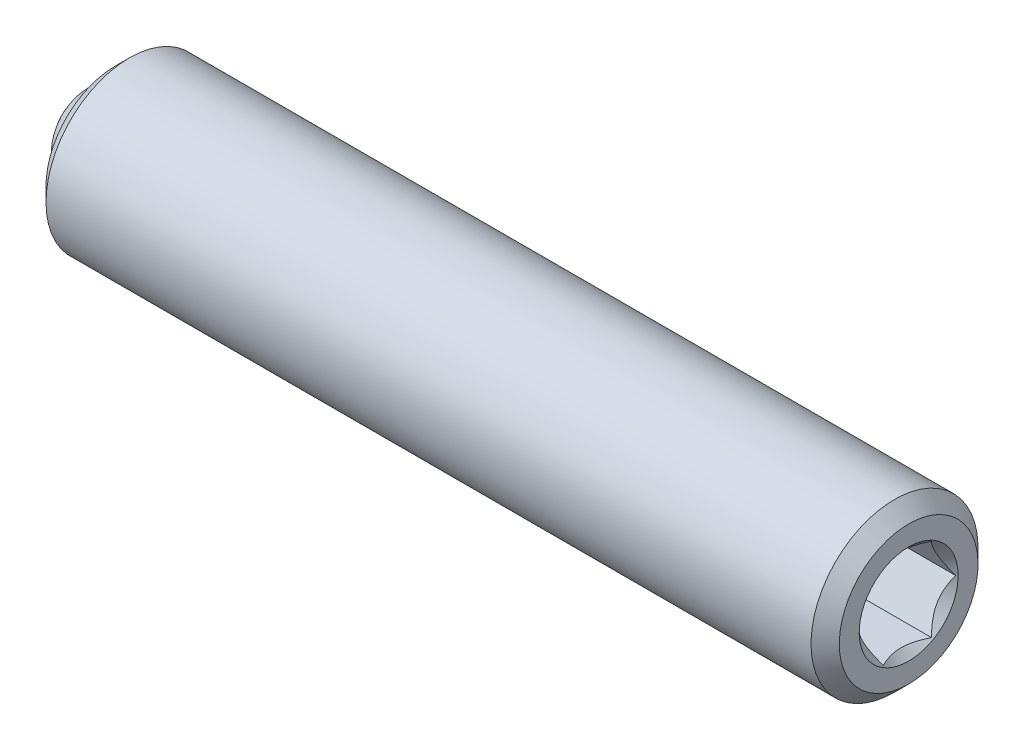
ISO-10303-21;
HEADER;
FILE_DESCRIPTION(('STEP AP214'),'2;1');
FILE_NAME('part.step','',(''),(''),'','','');
FILE_SCHEMA(('AUTOMOTIVE_DESIGN { 1 0 10303 214 1 1 1 1 }'));
ENDSEC;
DATA;
#1=APPLICATION_CONTEXT('core data for automotive mechanical design processes');
#2=APPLICATION_PROTOCOL_DEFINITION('international standard','automotive_design',2000,#1);
#3=PRODUCT_CONTEXT('',#1,'mechanical');
#4=PRODUCT('Part','Part','',(#3));
#5=PRODUCT_RELATED_PRODUCT_CATEGORY('part','',(#4));
#6=PRODUCT_DEFINITION_FORMATION('','',#4);
#7=PRODUCT_DEFINITION_CONTEXT('part definition',#1,'design');
#8=PRODUCT_DEFINITION('design','',#6,#7);
#9=PRODUCT_DEFINITION_SHAPE('','',#8);
#10=(LENGTH_UNIT() NAMED_UNIT(*) SI_UNIT(.MILLI.,.METRE.));
#11=(NAMED_UNIT(*) PLANE_ANGLE_UNIT() SI_UNIT($,.RADIAN.));
#12=(NAMED_UNIT(*) SI_UNIT($,.STERADIAN.) SOLID_ANGLE_UNIT());
#13=UNCERTAINTY_MEASURE_WITH_UNIT(LENGTH_MEASURE(1.E-05),#10,'distance_accuracy_value','');
#14=(GEOMETRIC_REPRESENTATION_CONTEXT(3) GLOBAL_UNCERTAINTY_ASSIGNED_CONTEXT((#13)) GLOBAL_UNIT_ASSIGNED_CONTEXT((#10,
#11,#12)) REPRESENTATION_CONTEXT('',''));
#15=CARTESIAN_POINT('',(0.,0.,0.));
#16=DIRECTION('',(0.,0.,1.));
#17=DIRECTION('',(1.,0.,0.));
#18=AXIS2_PLACEMENT_3D('',#15,#16,#17);
#19=CARTESIAN_POINT('',(-7.08387664832727,0.140112200938348,-0.203857779682182));
#20=DIRECTION('',(-1.,0.,0.));
#21=DIRECTION('',(0.,-1.,0.));
#22=AXIS2_PLACEMENT_3D('',#19,#20,#21);
#23=CONICAL_SURFACE('',#22,1.0033,0.78539816339745);
#24=CARTESIAN_POINT('',(-6.08057664832728,0.140112200938348,-0.203857779682182));
#25=VERTEX_POINT('',#24);
#26=VERTEX_LOOP('',#25);
#27=FACE_BOUND('',#26,.T.);
#28=CARTESIAN_POINT('',(-7.08387664832727,0.140112200938348,-0.203857779682182));
#29=DIRECTION('',(-1.,0.,0.));
#30=DIRECTION('',(0.,-1.,0.));
#31=AXIS2_PLACEMENT_3D('',#28,#29,#30);
#32=CIRCLE('',#31,1.0033);
#33=CARTESIAN_POINT('',(-7.08387664832727,-0.863187799061651,-0.203857779682182));
#34=VERTEX_POINT('',#33);
#35=EDGE_CURVE('P0_E102',#34,#34,#32,.T.);
#36=ORIENTED_EDGE('',*,*,#35,.T.);
#37=EDGE_LOOP('',(#36));
#38=FACE_BOUND('',#37,.T.);
#39=ADVANCED_FACE('P0_F17',(#27,#38),#23,.F.);
#40=CARTESIAN_POINT('',(6.49244103821644,0.140112200938348,-0.203857779682182));
#41=DIRECTION('',(-1.,0.,0.));
#42=DIRECTION('',(0.,-1.,0.));
#43=AXIS2_PLACEMENT_3D('',#40,#41,#42);
#44=PLANE('',#43);
#45=CARTESIAN_POINT('',(6.49244103821644,0.140112200938348,-0.203857779682182));
#46=DIRECTION('',(1.,0.,0.));
#47=DIRECTION('',(0.,1.,0.));
#48=AXIS2_PLACEMENT_3D('',#45,#46,#47);
#49=CIRCLE('',#48,0.889);
#50=CARTESIAN_POINT('',(6.49244103821644,1.02911220093835,-0.203857779682182));
#51=VERTEX_POINT('',#50);
#52=EDGE_CURVE('P0_E233',#51,#51,#49,.T.);
#53=ORIENTED_EDGE('',*,*,#52,.F.);
#54=EDGE_LOOP('',(#53));
#55=FACE_BOUND('',#54,.T.);
#56=CARTESIAN_POINT('',(6.49244103821644,0.140112200938348,-0.203857779682182));
#57=DIRECTION('',(-1.,0.,0.));
#58=DIRECTION('',(0.,-1.,0.));
#59=AXIS2_PLACEMENT_3D('',#56,#57,#58);
#60=CIRCLE('',#59,1.24600000000003);
#61=CARTESIAN_POINT('',(6.49244103821644,-1.10588779906168,-0.203857779682182));
#62=VERTEX_POINT('',#61);
#63=EDGE_CURVE('P0_E114',#62,#62,#60,.F.);
#64=ORIENTED_EDGE('',*,*,#63,.T.);
#65=EDGE_LOOP('',(#64));
#66=FACE_BOUND('',#65,.T.);
#67=ADVANCED_FACE('P0_F136',(#55,#66),#44,.F.);
#68=CARTESIAN_POINT('',(-6.08057664832728,0.140112200938348,-0.203857779682182));
#69=DIRECTION('',(-1.,0.,0.));
#70=DIRECTION('',(0.,-1.,0.));
#71=AXIS2_PLACEMENT_3D('',#68,#69,#70);
#72=CYLINDRICAL_SURFACE('',#71,1.50000000000001);
#73=CARTESIAN_POINT('',(6.23844103821645,0.140112200938348,-0.203857779682182));
#74=DIRECTION('',(-1.,0.,0.));
#75=DIRECTION('',(0.,-1.,0.));
#76=AXIS2_PLACEMENT_3D('',#73,#74,#75);
#77=CIRCLE('',#76,1.50000000000001);
#78=CARTESIAN_POINT('',(6.23844103821645,-1.35988779906166,-0.203857779682182));
#79=VERTEX_POINT('',#78);
#80=EDGE_CURVE('P0_E111',#79,#79,#77,.T.);
#81=ORIENTED_EDGE('',*,*,#80,.T.);
#82=EDGE_LOOP('',(#81));
#83=FACE_BOUND('',#82,.T.);
#84=CARTESIAN_POINT('',(-7.50295896178355,0.140112200938348,-0.203857779682182));
#85=DIRECTION('',(1.,0.,0.));
#86=DIRECTION('',(0.,1.,0.));
#87=AXIS2_PLACEMENT_3D('',#84,#85,#86);
#88=CIRCLE('',#87,1.50000000000001);
#89=CARTESIAN_POINT('',(-7.50295896178355,1.64011220093836,-0.203857779682182));
#90=VERTEX_POINT('',#89);
#91=EDGE_CURVE('P0_E108',#90,#90,#88,.T.);
#92=ORIENTED_EDGE('',*,*,#91,.T.);
#93=EDGE_LOOP('',(#92));
#94=FACE_BOUND('',#93,.T.);
#95=ADVANCED_FACE('P0_F141',(#83,#94),#72,.T.);
#96=CARTESIAN_POINT('',(-7.75695896178356,1.64011220093835,-0.203857779682182));
#97=DIRECTION('',(1.,0.,0.));
#98=DIRECTION('',(0.,1.,0.));
#99=AXIS2_PLACEMENT_3D('',#96,#97,#98);
#100=PLANE('',#99);
#101=CARTESIAN_POINT('',(-7.75695896178356,0.140112200938348,-0.203857779682182));
#102=DIRECTION('',(1.,0.,0.));
#103=DIRECTION('',(0.,1.,0.));
#104=AXIS2_PLACEMENT_3D('',#101,#102,#103);
#105=CIRCLE('',#104,1.246);
#106=CARTESIAN_POINT('',(-7.75695896178356,1.38611220093834,-0.203857779682182));
#107=VERTEX_POINT('',#106);
#108=EDGE_CURVE('P0_E30',#107,#107,#105,.F.);
#109=ORIENTED_EDGE('',*,*,#108,.T.);
#110=EDGE_LOOP('',(#109));
#111=FACE_BOUND('',#110,.T.);
#112=CARTESIAN_POINT('',(-7.75695896178356,0.140112200938348,-0.203857779682182));
#113=DIRECTION('',(-1.,0.,0.));
#114=DIRECTION('',(0.,-1.,0.));
#115=AXIS2_PLACEMENT_3D('',#112,#113,#114);
#116=CIRCLE('',#115,1.0033);
#117=CARTESIAN_POINT('',(-7.75695896178356,-0.863187799061651,-0.203857779682182));
#118=VERTEX_POINT('',#117);
#119=EDGE_CURVE('P0_E105',#118,#118,#116,.T.);
#120=ORIENTED_EDGE('',*,*,#119,.F.);
#121=EDGE_LOOP('',(#120));
#122=FACE_BOUND('',#121,.T.);
#123=ADVANCED_FACE('P0_F119',(#111,#122),#100,.F.);
#124=CARTESIAN_POINT('',(-6.08057664832728,0.140112200938348,-0.203857779682182));
#125=DIRECTION('',(-1.,0.,0.));
#126=DIRECTION('',(0.,-1.,0.));
#127=AXIS2_PLACEMENT_3D('',#124,#125,#126);
#128=CYLINDRICAL_SURFACE('',#127,1.0033);
#129=ORIENTED_EDGE('',*,*,#35,.F.);
#130=EDGE_LOOP('',(#129));
#131=FACE_BOUND('',#130,.T.);
#132=ORIENTED_EDGE('',*,*,#119,.T.);
#133=EDGE_LOOP('',(#132));
#134=FACE_BOUND('',#133,.T.);
#135=ADVANCED_FACE('P0_F132',(#131,#134),#128,.F.);
#136=CARTESIAN_POINT('',(6.23844103821645,0.140112200938348,-0.203857779682182));
#137=DIRECTION('',(-1.,0.,0.));
#138=DIRECTION('',(0.,-1.,0.));
#139=AXIS2_PLACEMENT_3D('',#136,#137,#138);
#140=CONICAL_SURFACE('',#139,1.50000000000001,0.785398163397447);
#141=ORIENTED_EDGE('',*,*,#63,.F.);
#142=EDGE_LOOP('',(#141));
#143=FACE_BOUND('',#142,.T.);
#144=ORIENTED_EDGE('',*,*,#80,.F.);
#145=EDGE_LOOP('',(#144));
#146=FACE_BOUND('',#145,.T.);
#147=ADVANCED_FACE('P0_F123',(#143,#146),#140,.T.);
#148=CARTESIAN_POINT('',(-7.75695896178356,0.140112200938348,-0.203857779682182));
#149=DIRECTION('',(1.,0.,0.));
#150=DIRECTION('',(0.,1.,0.));
#151=AXIS2_PLACEMENT_3D('',#148,#149,#150);
#152=CONICAL_SURFACE('',#151,1.246,0.785398163397447);
#153=ORIENTED_EDGE('',*,*,#91,.F.);
#154=EDGE_LOOP('',(#153));
#155=FACE_BOUND('',#154,.T.);
#156=ORIENTED_EDGE('',*,*,#108,.F.);
#157=EDGE_LOOP('',(#156));
#158=FACE_BOUND('',#157,.T.);
#159=ADVANCED_FACE('P0_F19',(#155,#158),#152,.T.);
#160=CARTESIAN_POINT('',(6.49244103821644,0.140112200938348,-0.203857779682182));
#161=DIRECTION('',(1.,0.,0.));
#162=DIRECTION('',(0.,1.,0.));
#163=AXIS2_PLACEMENT_3D('',#160,#161,#162);
#164=CONICAL_SURFACE('',#163,0.889,0.78539816339745);
#165=ORIENTED_EDGE('',*,*,#52,.T.);
#166=EDGE_LOOP('',(#165));
#167=FACE_BOUND('',#166,.T.);
#168=CARTESIAN_POINT('',(6.75931407340163,0.890112200938347,-1.08337041374052));
#169=CARTESIAN_POINT('',(6.74307468321521,0.890112200938347,-1.06202509157628));
#170=CARTESIAN_POINT('',(6.72698979157522,0.890112200938347,-1.04056255208413));
#171=CARTESIAN_POINT('',(6.69519327113775,0.890112200938347,-0.997354976569362));
#172=CARTESIAN_POINT('',(6.67948173410769,0.890112200938347,-0.975609873085506));
#173=CARTESIAN_POINT('',(6.6327791702077,0.890112200938347,-0.909560196027857));
#174=CARTESIAN_POINT('',(6.60247002806284,0.890112200938347,-0.864765498836228));
#175=CARTESIAN_POINT('',(6.54282204548442,0.890112200938347,-0.770727906260527));
#176=CARTESIAN_POINT('',(6.51364847758762,0.890112200938347,-0.721378973428742));
#177=CARTESIAN_POINT('',(6.46018003069421,0.890112200938347,-0.620199376924882));
#178=CARTESIAN_POINT('',(6.43586868692797,0.890112200938347,-0.568377850854046));
#179=CARTESIAN_POINT('',(6.40612427189313,0.890112200938347,-0.490735867713309));
#180=CARTESIAN_POINT('',(6.39761515008199,0.890112200938347,-0.466103184642786));
#181=CARTESIAN_POINT('',(6.38256731195443,0.890112200938347,-0.416242867264109));
#182=CARTESIAN_POINT('',(6.37602872705705,0.890112200938347,-0.391015193395759));
#183=CARTESIAN_POINT('',(6.36014826365661,0.890112200938347,-0.315512298621015));
#184=CARTESIAN_POINT('',(6.35414656519245,0.890112200938347,-0.264454169848514));
#185=CARTESIAN_POINT('',(6.35288028255774,0.890112200938347,-0.164196712133303));
#186=CARTESIAN_POINT('',(6.35720545625288,0.890112200938347,-0.115002678500581));
#187=CARTESIAN_POINT('',(6.37030376344025,0.890112200938347,-0.0420620616330128));
#188=CARTESIAN_POINT('',(6.37585433171372,0.890112200938347,-0.0176697553897667));
#189=CARTESIAN_POINT('',(6.38889014752514,0.890112200938347,0.0305909359954264));
#190=CARTESIAN_POINT('',(6.39637525349171,0.890112200938347,0.0544593593370273));
#191=CARTESIAN_POINT('',(6.42255528323793,0.890112200938347,0.128893354159198));
#192=CARTESIAN_POINT('',(6.44420389672139,0.890112200938347,0.178414114462773));
#193=CARTESIAN_POINT('',(6.49235487646798,0.890112200938347,0.275137718993898));
#194=CARTESIAN_POINT('',(6.51887453883852,0.890112200938347,0.3223315181746));
#195=CARTESIAN_POINT('',(6.57360802883982,0.890112200938347,0.412534674067127));
#196=CARTESIAN_POINT('',(6.60167299614644,0.890112200938347,0.455635521889964));
#197=CARTESIAN_POINT('',(6.64506742055101,0.890112200938347,0.519135833531514));
#198=CARTESIAN_POINT('',(6.6596869668323,0.890112200938347,0.540028947080531));
#199=CARTESIAN_POINT('',(6.68931508568023,0.890112200938347,0.58152917501731));
#200=CARTESIAN_POINT('',(6.70432355062861,0.890112200938347,0.602136366150134));
#201=CARTESIAN_POINT('',(6.7194933572417,0.890112200938347,0.622624391209399));
#202=B_SPLINE_CURVE_WITH_KNOTS('',3,(#168,#169,#170,#171,#172,#173,#174,#175,#176,#177,#178,
#179,#180,#181,#182,#183,#184,#185,#186,#187,#188,#189,#190,#191,#192,#193,#194,#195,#196,#197,
#198,#199,#200,#201),.UNSPECIFIED.,.F.,.F.,(4,2,2,2,2,2,2,2,2,2,2,2,2,2,2,2,4),(0.,
0.0804596117681744,0.160938799452028,0.323124453194973,0.494968571191812,0.666220542229087,
0.744331171665942,0.822447009304214,0.975597152051799,1.12276514368749,1.1977430644728,
1.27271549985279,1.4343836465341,1.59663734906444,1.75085876684992,1.82735598888854,
1.90383226465774),.UNSPECIFIED.);
#203=CARTESIAN_POINT('',(6.46946644200088,0.890112200938347,-0.636870481574401));
#204=VERTEX_POINT('',#203);
#205=CARTESIAN_POINT('',(6.46946644200088,0.890112200938347,0.229154922210038));
#206=VERTEX_POINT('',#205);
#207=EDGE_CURVE('P0_E86',#204,#206,#202,.T.);
#208=ORIENTED_EDGE('',*,*,#207,.F.);
#209=CARTESIAN_POINT('',(6.46958193514565,0.139912200938347,-1.06999865352046));
#210=CARTESIAN_POINT('',(6.4547005524648,0.165702163496029,-1.05510881169539));
#211=CARTESIAN_POINT('',(6.44069270760783,0.191923403067007,-1.0399699719706));
#212=CARTESIAN_POINT('',(6.41504396668314,0.245391909174054,-1.00909991557653));
#213=CARTESIAN_POINT('',(6.40341735370654,0.27264426839892,-0.993365758642001));
#214=CARTESIAN_POINT('',(6.38350048777312,0.327597551319701,-0.961638465954834));
#215=CARTESIAN_POINT('',(6.37516013608225,0.355284457633857,-0.945653423141328));
#216=CARTESIAN_POINT('',(6.3623091839623,0.411267796069201,-0.913331427625549));
#217=CARTESIAN_POINT('',(6.35778898258971,0.439562515781993,-0.896995463582723));
#218=CARTESIAN_POINT('',(6.35371227509831,0.488322490207191,-0.868843879222656));
#219=CARTESIAN_POINT('',(6.35310923861496,0.508724266593921,-0.857064908133831));
#220=CARTESIAN_POINT('',(6.3541209480164,0.549488335634708,-0.833529761899868));
#221=CARTESIAN_POINT('',(6.35573618299091,0.569850618589803,-0.821773592354429));
#222=CARTESIAN_POINT('',(6.36380258897392,0.630646744025172,-0.786672932968632));
#223=CARTESIAN_POINT('',(6.3734753778286,0.670778055934447,-0.763503109234879));
#224=CARTESIAN_POINT('',(6.39682275997319,0.741222601292374,-0.72283193200954));
#225=CARTESIAN_POINT('',(6.40927500007313,0.771865772947434,-0.705140088605666));
#226=CARTESIAN_POINT('',(6.43732605223174,0.831951546743137,-0.67044955093025));
#227=CARTESIAN_POINT('',(6.45291462790463,0.861397689319938,-0.653448812586938));
#228=CARTESIAN_POINT('',(6.46958193514565,0.890312200938347,-0.636755011520563));
#229=B_SPLINE_CURVE_WITH_KNOTS('',3,(#209,#210,#211,#212,#213,#214,#215,#216,#217,#218,#219,
#220,#221,#222,#223,#224,#225,#226,#227,#228),.UNSPECIFIED.,.F.,.F.,(4,2,2,2,2,2,2,2,2,4),(0.,
0.0999419466095603,0.200466857654447,0.299393763705718,0.398071297300231,0.468665775681749,
0.53927582139884,0.680536257244567,0.792918418368074,0.904939568716032),.UNSPECIFIED.);
#230=CARTESIAN_POINT('',(6.46946644200088,0.140112200938347,-1.06988318346662));
#231=VERTEX_POINT('',#230);
#232=EDGE_CURVE('P0_E188',#231,#204,#229,.T.);
#233=ORIENTED_EDGE('',*,*,#232,.F.);
#234=CARTESIAN_POINT('',(6.46958193514565,-0.610087799061653,-0.636755011520563));
#235=CARTESIAN_POINT('',(6.4547005524648,-0.584297836503971,-0.651644853345631));
#236=CARTESIAN_POINT('',(6.44069270760783,-0.558076596932993,-0.666783693070421));
#237=CARTESIAN_POINT('',(6.41504396668314,-0.504608090825946,-0.697653749464491));
#238=CARTESIAN_POINT('',(6.40341735370655,-0.47735573160108,-0.71338790639902));
#239=CARTESIAN_POINT('',(6.38350048777312,-0.422402448680299,-0.745115199086187));
#240=CARTESIAN_POINT('',(6.37516013608225,-0.394715542366143,-0.761100241899693));
#241=CARTESIAN_POINT('',(6.3623091839623,-0.338732203930799,-0.793422237415473));
#242=CARTESIAN_POINT('',(6.35778898258971,-0.310437484218007,-0.809758201458298));
#243=CARTESIAN_POINT('',(6.35371227509831,-0.261677509792809,-0.837909785818366));
#244=CARTESIAN_POINT('',(6.35310923861496,-0.241275733406079,-0.84968875690719));
#245=CARTESIAN_POINT('',(6.3541209480164,-0.200511664365292,-0.873223903141154));
#246=CARTESIAN_POINT('',(6.35573618299091,-0.180149381410197,-0.884980072686593));
#247=CARTESIAN_POINT('',(6.36380258897392,-0.119353255974828,-0.920080732072389));
#248=CARTESIAN_POINT('',(6.3734753778286,-0.0792219440655525,-0.943250555806142));
#249=CARTESIAN_POINT('',(6.39682275997319,-0.00877739870762611,-0.983921733031482));
#250=CARTESIAN_POINT('',(6.40927500007313,0.0218657729474343,-1.00161357643536));
#251=CARTESIAN_POINT('',(6.43732605223174,0.0819515467431373,-1.03630411411077));
#252=CARTESIAN_POINT('',(6.45291462790463,0.111397689319938,-1.05330485245408));
#253=CARTESIAN_POINT('',(6.46958193514565,0.140312200938347,-1.06999865352046));
#254=B_SPLINE_CURVE_WITH_KNOTS('',3,(#234,#235,#236,#237,#238,#239,#240,#241,#242,#243,#244,
#245,#246,#247,#248,#249,#250,#251,#252,#253),.UNSPECIFIED.,.F.,.F.,(4,2,2,2,2,2,2,2,2,4),(0.,
0.0999419466095599,0.200466857654447,0.299393763705718,0.398071297300232,0.468665775681749,
0.539275821398841,0.680536257244568,0.792918418368075,0.904939568716032),.UNSPECIFIED.);
#255=CARTESIAN_POINT('',(6.46946644200088,-0.609887799061653,-0.636870481574401));
#256=VERTEX_POINT('',#255);
#257=EDGE_CURVE('P0_E183',#256,#231,#254,.T.);
#258=ORIENTED_EDGE('',*,*,#257,.F.);
#259=CARTESIAN_POINT('',(6.75931407342134,-0.609887799061653,-1.08337041376642));
#260=CARTESIAN_POINT('',(6.74307468323415,-0.609887799061653,-1.06202509160144));
#261=CARTESIAN_POINT('',(6.72698979159341,-0.609887799061653,-1.04056255210855));
#262=CARTESIAN_POINT('',(6.69519327115442,-0.609887799061653,-0.997354976592303));
#263=CARTESIAN_POINT('',(6.6794817341236,-0.609887799061653,-0.975609873107702));
#264=CARTESIAN_POINT('',(6.63277917022134,-0.609887799061653,-0.909560196047774));
#265=CARTESIAN_POINT('',(6.60247002807497,-0.609887799061653,-0.864765498854594));
#266=CARTESIAN_POINT('',(6.54282204549342,-0.609887799061653,-0.770727906275514));
#267=CARTESIAN_POINT('',(6.51364847759503,-0.609887799061653,-0.72137897344189));
#268=CARTESIAN_POINT('',(6.46018003069867,-0.609887799061653,-0.620199376934195));
#269=CARTESIAN_POINT('',(6.43586868693107,-0.609887799061653,-0.568377850861364));
#270=CARTESIAN_POINT('',(6.40612427189523,-0.609887799061653,-0.490735867719131));
#271=CARTESIAN_POINT('',(6.39761515008414,-0.609887799061653,-0.466103184649244));
#272=CARTESIAN_POINT('',(6.38256731195656,-0.609887799061653,-0.416242867271859));
#273=CARTESIAN_POINT('',(6.37602872705911,-0.609887799061653,-0.391015193404165));
#274=CARTESIAN_POINT('',(6.36014826365822,-0.609887799061653,-0.315512298631347));
#275=CARTESIAN_POINT('',(6.35414656519346,-0.609887799061653,-0.264454169860129));
#276=CARTESIAN_POINT('',(6.35288028255708,-0.609887799061653,-0.16419671214712));
#277=CARTESIAN_POINT('',(6.35720545625119,-0.609887799061653,-0.115002678515324));
#278=CARTESIAN_POINT('',(6.37030376343688,-0.609887799061653,-0.0420620616490265));
#279=CARTESIAN_POINT('',(6.37585433170976,-0.609887799061653,-0.0176697554062025));
#280=CARTESIAN_POINT('',(6.38889014752,-0.609887799061653,0.0305909359781876));
#281=CARTESIAN_POINT('',(6.39637525348597,-0.609887799061653,0.0544593593194076));
#282=CARTESIAN_POINT('',(6.4225552832294,-0.609887799061653,0.128893354137779));
#283=CARTESIAN_POINT('',(6.44420389671029,-0.609887799061653,0.178414114438127));
#284=CARTESIAN_POINT('',(6.49235487645145,-0.609887799061653,0.275137718963045));
#285=CARTESIAN_POINT('',(6.51887453881914,-0.609887799061653,0.32233151814077));
#286=CARTESIAN_POINT('',(6.57360802881497,-0.609887799061653,0.412534674027946));
#287=CARTESIAN_POINT('',(6.601672996119,-0.609887799061653,0.455635521848392));
#288=CARTESIAN_POINT('',(6.64506742051971,-0.609887799061653,0.519135833486406));
#289=CARTESIAN_POINT('',(6.65968696679972,-0.609887799061653,0.540028947034261));
#290=CARTESIAN_POINT('',(6.6893150856451,-0.609887799061653,0.581529174968724));
#291=CARTESIAN_POINT('',(6.70432355059219,-0.609887799061653,0.602136366100394));
#292=CARTESIAN_POINT('',(6.71949335720401,-0.609887799061653,0.622624391158506));
#293=B_SPLINE_CURVE_WITH_KNOTS('',3,(#259,#260,#261,#262,#263,#264,#265,#266,#267,#268,#269,
#270,#271,#272,#273,#274,#275,#276,#277,#278,#279,#280,#281,#282,#283,#284,#285,#286,#287,#288,
#289,#290,#291,#292),.UNSPECIFIED.,.F.,.F.,(4,2,2,2,2,2,2,2,2,2,2,2,2,2,2,2,4),(0.,
0.0804596117713113,0.160938799458303,0.323124453207641,0.494968571211659,0.666220542256045,
0.744331171691052,0.82244700932748,0.975597152071551,1.12276514370424,1.19774306448793,
1.27271549986629,1.43438364653569,1.59663734905404,1.75085876682928,1.82735598886285,
1.90383226462699),.UNSPECIFIED.);
#294=CARTESIAN_POINT('',(6.46946644200088,-0.609887799061653,0.229154922210038));
#295=VERTEX_POINT('',#294);
#296=EDGE_CURVE('P0_E37',#295,#256,#293,.F.);
#297=ORIENTED_EDGE('',*,*,#296,.F.);
#298=CARTESIAN_POINT('',(6.46958193514565,0.140312200938347,0.662283094156095));
#299=CARTESIAN_POINT('',(6.4547005524648,0.114522238380666,0.647393252331027));
#300=CARTESIAN_POINT('',(6.44069270760783,0.0883009988096879,0.632254412606237));
#301=CARTESIAN_POINT('',(6.41504396668314,0.034832492702641,0.601384356212167));
#302=CARTESIAN_POINT('',(6.40341735370654,0.00758013347777476,0.585650199277638));
#303=CARTESIAN_POINT('',(6.38350048777312,-0.0473731494430053,0.553922906590472));
#304=CARTESIAN_POINT('',(6.37516013608225,-0.0750600557571615,0.537937863776966));
#305=CARTESIAN_POINT('',(6.3623091839623,-0.131043394192505,0.505615868261186));
#306=CARTESIAN_POINT('',(6.35778898258971,-0.159338113905297,0.489279904218361));
#307=CARTESIAN_POINT('',(6.35371227509831,-0.208098088330495,0.461128319858294));
#308=CARTESIAN_POINT('',(6.35310923861496,-0.228499864717224,0.449349348769469));
#309=CARTESIAN_POINT('',(6.3541209480164,-0.269263933758012,0.425814202535506));
#310=CARTESIAN_POINT('',(6.35573618299091,-0.289626216713107,0.414058032990066));
#311=CARTESIAN_POINT('',(6.36380258897392,-0.350422342148476,0.37895737360427));
#312=CARTESIAN_POINT('',(6.3734753778286,-0.390553654057751,0.355787549870517));
#313=CARTESIAN_POINT('',(6.39682275997319,-0.460998199415678,0.315116372645177));
#314=CARTESIAN_POINT('',(6.40927500007313,-0.491641371070739,0.297424529241304));
#315=CARTESIAN_POINT('',(6.43732605223174,-0.551727144866442,0.262733991565887));
#316=CARTESIAN_POINT('',(6.45291462790463,-0.581173287443243,0.245733253222575));
#317=CARTESIAN_POINT('',(6.46958193514565,-0.610087799061653,0.2290394521562));
#318=B_SPLINE_CURVE_WITH_KNOTS('',3,(#298,#299,#300,#301,#302,#303,#304,#305,#306,#307,#308,
#309,#310,#311,#312,#313,#314,#315,#316,#317),.UNSPECIFIED.,.F.,.F.,(4,2,2,2,2,2,2,2,2,4),(0.,
0.0999419466095594,0.200466857654445,0.299393763705716,0.398071297300229,0.468665775681746,
0.539275821398838,0.680536257244565,0.792918418368073,0.904939568716032),.UNSPECIFIED.);
#319=CARTESIAN_POINT('',(6.46946644200088,0.140112200938347,0.662167624102257));
#320=VERTEX_POINT('',#319);
#321=EDGE_CURVE('P0_E11',#320,#295,#318,.T.);
#322=ORIENTED_EDGE('',*,*,#321,.F.);
#323=CARTESIAN_POINT('',(6.46958193514565,0.890312200938347,0.2290394521562));
#324=CARTESIAN_POINT('',(6.4547005524648,0.864522238380666,0.243929293981268));
#325=CARTESIAN_POINT('',(6.44069270760783,0.838300998809688,0.259068133706057));
#326=CARTESIAN_POINT('',(6.41504396668314,0.784832492702641,0.289938190100128));
#327=CARTESIAN_POINT('',(6.40341735370654,0.757580133477775,0.305672347034657));
#328=CARTESIAN_POINT('',(6.38350048777312,0.702626850556994,0.337399639721823));
#329=CARTESIAN_POINT('',(6.37516013608225,0.674939944242838,0.353384682535329));
#330=CARTESIAN_POINT('',(6.3623091839623,0.618956605807494,0.385706678051109));
#331=CARTESIAN_POINT('',(6.35778898258971,0.590661886094703,0.402042642093934));
#332=CARTESIAN_POINT('',(6.35371227509831,0.541901911669504,0.430194226454002));
#333=CARTESIAN_POINT('',(6.35310923861496,0.521500135282775,0.441973197542826));
#334=CARTESIAN_POINT('',(6.3541209480164,0.480736066241988,0.465508343776789));
#335=CARTESIAN_POINT('',(6.35573618299091,0.460373783286893,0.477264513322229));
#336=CARTESIAN_POINT('',(6.36380258897392,0.399577657851524,0.512365172708025));
#337=CARTESIAN_POINT('',(6.3734753778286,0.359446345942249,0.535534996441778));
#338=CARTESIAN_POINT('',(6.39682275997319,0.289001800584322,0.576206173667118));
#339=CARTESIAN_POINT('',(6.40927500007313,0.258358628929261,0.593898017070991));
#340=CARTESIAN_POINT('',(6.43732605223174,0.198272855133557,0.628588554746408));
#341=CARTESIAN_POINT('',(6.45291462790463,0.168826712556756,0.64558929308972));
#342=CARTESIAN_POINT('',(6.46958193514565,0.139912200938347,0.662283094156095));
#343=B_SPLINE_CURVE_WITH_KNOTS('',3,(#323,#324,#325,#326,#327,#328,#329,#330,#331,#332,#333,
#334,#335,#336,#337,#338,#339,#340,#341,#342),.UNSPECIFIED.,.F.,.F.,(4,2,2,2,2,2,2,2,2,4),(0.,
0.0999419466095594,0.200466857654446,0.299393763705717,0.39807129730023,0.468665775681747,
0.539275821398839,0.680536257244566,0.792918418368073,0.904939568716032),.UNSPECIFIED.);
#344=EDGE_CURVE('P0_E73',#206,#320,#343,.T.);
#345=ORIENTED_EDGE('',*,*,#344,.F.);
#346=EDGE_LOOP('',(#208,#233,#258,#297,#322,#345));
#347=FACE_BOUND('',#346,.T.);
#348=ADVANCED_FACE('P0_F72',(#167,#347),#164,.F.);
#349=CARTESIAN_POINT('',(3.44444103821644,0.140112200938347,-0.203857779682182));
#350=DIRECTION('',(1.,0.,0.));
#351=DIRECTION('',(0.,0.,-1.));
#352=AXIS2_PLACEMENT_3D('',#349,#350,#351);
#353=PLANE('',#352);
#354=DIRECTION('',(0.,-0.866025403784439,0.5));
#355=VECTOR('',#354,1.);
#356=CARTESIAN_POINT('',(3.44444103821644,0.890112200938347,0.229154922210038));
#357=LINE('',#356,#355);
#358=CARTESIAN_POINT('',(3.44444103821644,0.890112200938347,0.229154922210038));
#359=VERTEX_POINT('',#358);
#360=CARTESIAN_POINT('',(3.44444103821644,0.140112200938347,0.662167624102257));
#361=VERTEX_POINT('',#360);
#362=EDGE_CURVE('P0_E85',#359,#361,#357,.T.);
#363=ORIENTED_EDGE('',*,*,#362,.T.);
#364=DIRECTION('',(0.,-0.866025403784438,-0.5));
#365=VECTOR('',#364,1.);
#366=CARTESIAN_POINT('',(3.44444103821644,0.140112200938347,0.662167624102257));
#367=LINE('',#366,#365);
#368=CARTESIAN_POINT('',(3.44444103821644,-0.609887799061653,0.229154922210038));
#369=VERTEX_POINT('',#368);
#370=EDGE_CURVE('P0_E90',#361,#369,#367,.T.);
#371=ORIENTED_EDGE('',*,*,#370,.T.);
#372=DIRECTION('',(0.,0.,-1.));
#373=VECTOR('',#372,1.);
#374=CARTESIAN_POINT('',(3.44444103821644,-0.609887799061653,0.229154922210038));
#375=LINE('',#374,#373);
#376=CARTESIAN_POINT('',(3.44444103821644,-0.609887799061653,-0.636870481574401));
#377=VERTEX_POINT('',#376);
#378=EDGE_CURVE('P0_E213',#369,#377,#375,.T.);
#379=ORIENTED_EDGE('',*,*,#378,.T.);
#380=DIRECTION('',(0.,0.866025403784439,-0.5));
#381=VECTOR('',#380,1.);
#382=CARTESIAN_POINT('',(3.44444103821644,-0.609887799061653,-0.636870481574401));
#383=LINE('',#382,#381);
#384=CARTESIAN_POINT('',(3.44444103821644,0.140112200938347,-1.06988318346662));
#385=VERTEX_POINT('',#384);
#386=EDGE_CURVE('P0_E217',#377,#385,#383,.T.);
#387=ORIENTED_EDGE('',*,*,#386,.T.);
#388=DIRECTION('',(0.,0.866025403784439,0.5));
#389=VECTOR('',#388,1.);
#390=CARTESIAN_POINT('',(3.44444103821644,0.140112200938347,-1.06988318346662));
#391=LINE('',#390,#389);
#392=CARTESIAN_POINT('',(3.44444103821644,0.890112200938347,-0.636870481574401));
#393=VERTEX_POINT('',#392);
#394=EDGE_CURVE('P0_E98',#385,#393,#391,.T.);
#395=ORIENTED_EDGE('',*,*,#394,.T.);
#396=DIRECTION('',(0.,0.,1.));
#397=VECTOR('',#396,1.);
#398=CARTESIAN_POINT('',(3.44444103821644,0.890112200938347,-0.636870481574401));
#399=LINE('',#398,#397);
#400=EDGE_CURVE('P0_E93',#393,#359,#399,.T.);
#401=ORIENTED_EDGE('',*,*,#400,.T.);
#402=EDGE_LOOP('',(#363,#371,#379,#387,#395,#401));
#403=FACE_BOUND('',#402,.T.);
#404=ADVANCED_FACE('P0_F130',(#403),#353,.T.);
#405=CARTESIAN_POINT('',(3.44444103821644,0.140112200938347,0.662167624102257));
#406=DIRECTION('',(0.,-0.5,0.866025403784438));
#407=DIRECTION('',(0.,-0.866025403784439,-0.5));
#408=AXIS2_PLACEMENT_3D('',#405,#406,#407);
#409=PLANE('',#408);
#410=DIRECTION('',(1.,0.,0.));
#411=VECTOR('',#410,1.);
#412=CARTESIAN_POINT('',(3.44444103821644,0.140112200938347,0.662167624102257));
#413=LINE('',#412,#411);
#414=EDGE_CURVE('P0_E82',#361,#320,#413,.T.);
#415=ORIENTED_EDGE('',*,*,#414,.T.);
#416=ORIENTED_EDGE('',*,*,#321,.T.);
#417=DIRECTION('',(1.,0.,0.));
#418=VECTOR('',#417,1.);
#419=CARTESIAN_POINT('',(3.44444103821644,-0.609887799061653,0.229154922210038));
#420=LINE('',#419,#418);
#421=EDGE_CURVE('P0_E92',#369,#295,#420,.T.);
#422=ORIENTED_EDGE('',*,*,#421,.F.);
#423=ORIENTED_EDGE('',*,*,#370,.F.);
#424=EDGE_LOOP('',(#415,#416,#422,#423));
#425=FACE_BOUND('',#424,.T.);
#426=ADVANCED_FACE('P0_F88',(#425),#409,.F.);
#427=CARTESIAN_POINT('',(3.44444103821644,-0.609887799061653,0.229154922210038));
#428=DIRECTION('',(0.,-1.,0.));
#429=DIRECTION('',(1.,0.,0.));
#430=AXIS2_PLACEMENT_3D('',#427,#428,#429);
#431=PLANE('',#430);
#432=ORIENTED_EDGE('',*,*,#421,.T.);
#433=ORIENTED_EDGE('',*,*,#296,.T.);
#434=DIRECTION('',(1.,0.,0.));
#435=VECTOR('',#434,1.);
#436=CARTESIAN_POINT('',(3.44444103821644,-0.609887799061653,-0.636870481574401));
#437=LINE('',#436,#435);
#438=EDGE_CURVE('P0_E95',#377,#256,#437,.T.);
#439=ORIENTED_EDGE('',*,*,#438,.F.);
#440=ORIENTED_EDGE('',*,*,#378,.F.);
#441=EDGE_LOOP('',(#432,#433,#439,#440));
#442=FACE_BOUND('',#441,.T.);
#443=ADVANCED_FACE('P0_F202',(#442),#431,.F.);
#444=CARTESIAN_POINT('',(3.44444103821644,-0.609887799061653,-0.636870481574401));
#445=DIRECTION('',(0.,-0.5,-0.866025403784439));
#446=DIRECTION('',(0.,0.866025403784439,-0.5));
#447=AXIS2_PLACEMENT_3D('',#444,#445,#446);
#448=PLANE('',#447);
#449=ORIENTED_EDGE('',*,*,#438,.T.);
#450=ORIENTED_EDGE('',*,*,#257,.T.);
#451=DIRECTION('',(1.,0.,0.));
#452=VECTOR('',#451,1.);
#453=CARTESIAN_POINT('',(3.44444103821644,0.140112200938347,-1.06988318346662));
#454=LINE('',#453,#452);
#455=EDGE_CURVE('P0_E227',#385,#231,#454,.T.);
#456=ORIENTED_EDGE('',*,*,#455,.F.);
#457=ORIENTED_EDGE('',*,*,#386,.F.);
#458=EDGE_LOOP('',(#449,#450,#456,#457));
#459=FACE_BOUND('',#458,.T.);
#460=ADVANCED_FACE('P0_F197',(#459),#448,.F.);
#461=CARTESIAN_POINT('',(3.44444103821644,0.140112200938347,-1.06988318346662));
#462=DIRECTION('',(0.,0.5,-0.866025403784439));
#463=DIRECTION('',(0.,0.866025403784439,0.5));
#464=AXIS2_PLACEMENT_3D('',#461,#462,#463);
#465=PLANE('',#464);
#466=ORIENTED_EDGE('',*,*,#455,.T.);
#467=ORIENTED_EDGE('',*,*,#232,.T.);
#468=DIRECTION('',(1.,0.,0.));
#469=VECTOR('',#468,1.);
#470=CARTESIAN_POINT('',(3.44444103821644,0.890112200938347,-0.636870481574401));
#471=LINE('',#470,#469);
#472=EDGE_CURVE('P0_E224',#393,#204,#471,.T.);
#473=ORIENTED_EDGE('',*,*,#472,.F.);
#474=ORIENTED_EDGE('',*,*,#394,.F.);
#475=EDGE_LOOP('',(#466,#467,#473,#474));
#476=FACE_BOUND('',#475,.T.);
#477=ADVANCED_FACE('P0_F194',(#476),#465,.F.);
#478=CARTESIAN_POINT('',(3.44444103821644,0.890112200938347,-0.636870481574401));
#479=DIRECTION('',(0.,1.,0.));
#480=DIRECTION('',(0.,0.,1.));
#481=AXIS2_PLACEMENT_3D('',#478,#479,#480);
#482=PLANE('',#481);
#483=ORIENTED_EDGE('',*,*,#472,.T.);
#484=ORIENTED_EDGE('',*,*,#207,.T.);
#485=DIRECTION('',(1.,0.,0.));
#486=VECTOR('',#485,1.);
#487=CARTESIAN_POINT('',(3.44444103821644,0.890112200938347,0.229154922210038));
#488=LINE('',#487,#486);
#489=EDGE_CURVE('P0_E84',#359,#206,#488,.T.);
#490=ORIENTED_EDGE('',*,*,#489,.F.);
#491=ORIENTED_EDGE('',*,*,#400,.F.);
#492=EDGE_LOOP('',(#483,#484,#490,#491));
#493=FACE_BOUND('',#492,.T.);
#494=ADVANCED_FACE('P0_F156',(#493),#482,.F.);
#495=CARTESIAN_POINT('',(3.44444103821644,0.890112200938347,0.229154922210038));
#496=DIRECTION('',(0.,0.5,0.866025403784439));
#497=DIRECTION('',(0.,-0.866025403784439,0.5));
#498=AXIS2_PLACEMENT_3D('',#495,#496,#497);
#499=PLANE('',#498);
#500=ORIENTED_EDGE('',*,*,#489,.T.);
#501=ORIENTED_EDGE('',*,*,#344,.T.);
#502=ORIENTED_EDGE('',*,*,#414,.F.);
#503=ORIENTED_EDGE('',*,*,#362,.F.);
#504=EDGE_LOOP('',(#500,#501,#502,#503));
#505=FACE_BOUND('',#504,.T.);
#506=ADVANCED_FACE('P0_F80',(#505),#499,.F.);
#507=CLOSED_SHELL('',(#39,#67,#95,#123,#135,#147,#159,#348,#404,#426,#443,#460,#477,#494,#506));
#508=MANIFOLD_SOLID_BREP('P0_B1',#507);
#509=CARTESIAN_POINT('',(-7.49478738227326,0.140112200938352,-0.203857779682184));
#510=DIRECTION('',(1.,0.,0.));
#511=DIRECTION('',(0.,0.998020621808946,-0.0628875062638402));
#512=AXIS2_PLACEMENT_3D('',#509,#510,#511);
#513=SPHERICAL_SURFACE('',#512,0.999998);
#514=CARTESIAN_POINT('',(-7.49478738227326,0.140112200938352,-0.203857779682184));
#515=DIRECTION('',(0.,-0.0628875062638402,-0.998020621808946));
#516=DIRECTION('',(0.,0.998020621808946,-0.0628875062638402));
#517=AXIS2_PLACEMENT_3D('',#514,#515,#516);
#518=CIRCLE('',#517,0.999998);
#519=CARTESIAN_POINT('',(-7.49478738227326,1.13813082670605,-0.266745160171012));
#520=VERTEX_POINT('',#519);
#521=CARTESIAN_POINT('',(-7.49478738227326,-0.857906424829351,-0.140970399193356));
#522=VERTEX_POINT('',#521);
#523=EDGE_CURVE('P1_E33',#520,#522,#518,.T.);
#524=ORIENTED_EDGE('',*,*,#523,.T.);
#525=CARTESIAN_POINT('',(-7.49478738227326,0.140112200938352,-0.203857779682184));
#526=DIRECTION('',(1.,0.,0.));
#527=DIRECTION('',(0.,-0.0628875062638402,-0.998020621808946));
#528=AXIS2_PLACEMENT_3D('',#525,#526,#527);
#529=CIRCLE('',#528,0.999998);
#530=EDGE_CURVE('P1_E10',#522,#520,#529,.T.);
#531=ORIENTED_EDGE('',*,*,#530,.T.);
#532=EDGE_LOOP('',(#524,#531));
#533=FACE_BOUND('',#532,.T.);
#534=ADVANCED_FACE('P1_F16',(#533),#513,.T.);
#535=ORIENTED_EDGE('',*,*,#523,.F.);
#536=CARTESIAN_POINT('',(-7.49478738227326,0.140112200938352,-0.203857779682184));
#537=DIRECTION('',(1.,0.,0.));
#538=DIRECTION('',(0.,-0.0628875062638402,-0.998020621808946));
#539=AXIS2_PLACEMENT_3D('',#536,#537,#538);
#540=CIRCLE('',#539,0.999998);
#541=EDGE_CURVE('P1_E23',#520,#522,#540,.T.);
#542=ORIENTED_EDGE('',*,*,#541,.T.);
#543=EDGE_LOOP('',(#535,#542));
#544=FACE_BOUND('',#543,.T.);
#545=ADVANCED_FACE('P1_F40',(#544),#513,.T.);
#546=ORIENTED_EDGE('',*,*,#530,.F.);
#547=EDGE_CURVE('P1_E36',#522,#520,#518,.T.);
#548=ORIENTED_EDGE('',*,*,#547,.T.);
#549=EDGE_LOOP('',(#546,#548));
#550=FACE_BOUND('',#549,.T.);
#551=ADVANCED_FACE('P1_F38',(#550),#513,.T.);
#552=ORIENTED_EDGE('',*,*,#541,.F.);
#553=ORIENTED_EDGE('',*,*,#547,.F.);
#554=EDGE_LOOP('',(#552,#553));
#555=FACE_BOUND('',#554,.T.);
#556=ADVANCED_FACE('P1_F18',(#555),#513,.T.);
#557=CLOSED_SHELL('',(#534,#545,#551,#556));
#558=MANIFOLD_SOLID_BREP('P1_B1',#557);
#559=ADVANCED_BREP_SHAPE_REPRESENTATION('',(#18,#508,#558),#14);
#560=SHAPE_DEFINITION_REPRESENTATION(#9,#559);
ENDSEC;
END-ISO-10303-21;
